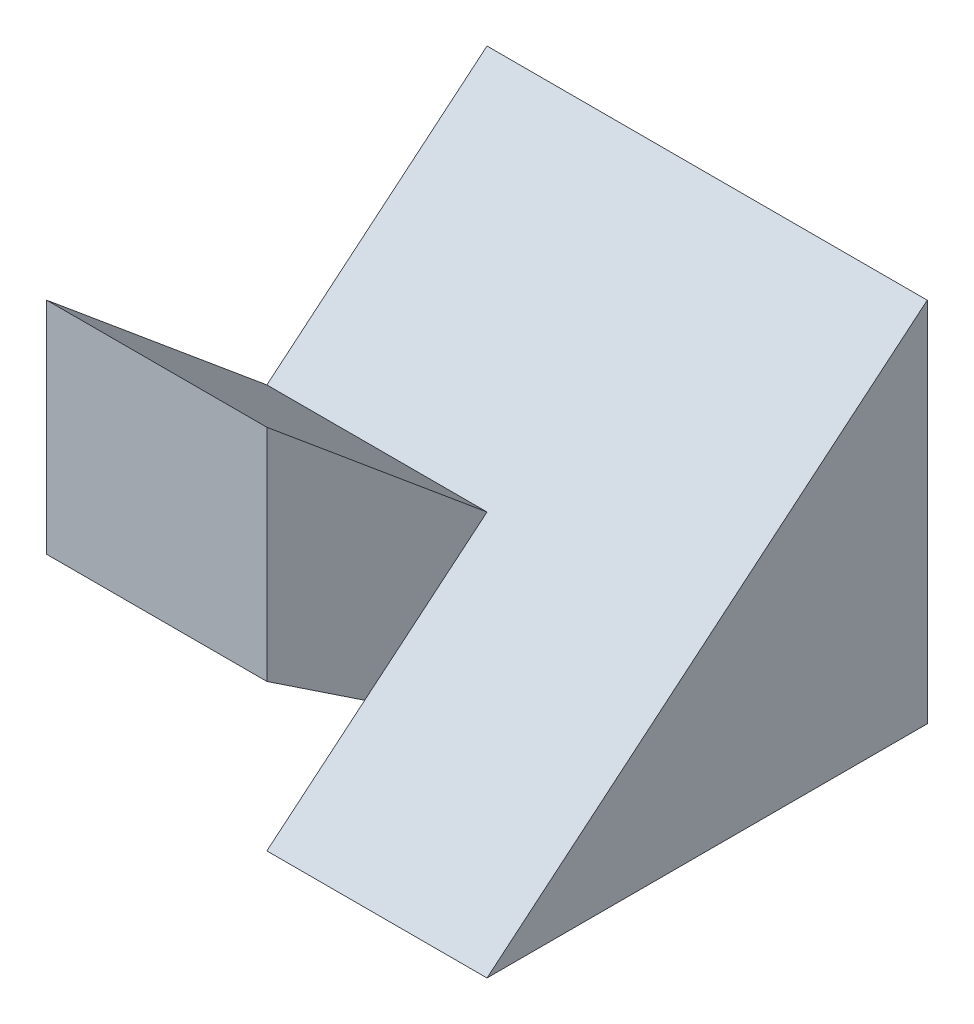
ISO-10303-21;
HEADER;
FILE_DESCRIPTION(('STEP AP214'),'2;1');
FILE_NAME('part.step','',(''),(''),'','','');
FILE_SCHEMA(('AUTOMOTIVE_DESIGN { 1 0 10303 214 1 1 1 1 }'));
ENDSEC;
DATA;
#1=APPLICATION_CONTEXT('core data for automotive mechanical design processes');
#2=APPLICATION_PROTOCOL_DEFINITION('international standard','automotive_design',2000,#1);
#3=PRODUCT_CONTEXT('',#1,'mechanical');
#4=PRODUCT('Part','Part','',(#3));
#5=PRODUCT_RELATED_PRODUCT_CATEGORY('part','',(#4));
#6=PRODUCT_DEFINITION_FORMATION('','',#4);
#7=PRODUCT_DEFINITION_CONTEXT('part definition',#1,'design');
#8=PRODUCT_DEFINITION('design','',#6,#7);
#9=PRODUCT_DEFINITION_SHAPE('','',#8);
#10=(LENGTH_UNIT() NAMED_UNIT(*) SI_UNIT(.MILLI.,.METRE.));
#11=(NAMED_UNIT(*) PLANE_ANGLE_UNIT() SI_UNIT($,.RADIAN.));
#12=(NAMED_UNIT(*) SI_UNIT($,.STERADIAN.) SOLID_ANGLE_UNIT());
#13=UNCERTAINTY_MEASURE_WITH_UNIT(LENGTH_MEASURE(1.E-05),#10,'distance_accuracy_value','');
#14=(GEOMETRIC_REPRESENTATION_CONTEXT(3) GLOBAL_UNCERTAINTY_ASSIGNED_CONTEXT((#13)) GLOBAL_UNIT_ASSIGNED_CONTEXT((#10,
#11,#12)) REPRESENTATION_CONTEXT('',''));
#15=CARTESIAN_POINT('',(0.,0.,0.));
#16=DIRECTION('',(0.,0.,1.));
#17=DIRECTION('',(1.,0.,0.));
#18=AXIS2_PLACEMENT_3D('',#15,#16,#17);
#19=CARTESIAN_POINT('',(3.,5.,3.));
#20=DIRECTION('',(-1.,0.,0.));
#21=DIRECTION('',(0.,0.,1.));
#22=AXIS2_PLACEMENT_3D('',#19,#20,#21);
#23=PLANE('',#22);
#24=DIRECTION('',(0.,-0.64018439966448,0.768221279597376));
#25=VECTOR('',#24,1.);
#26=CARTESIAN_POINT('',(3.,2.04918032786885,0.540983606557377));
#27=LINE('',#26,#25);
#28=CARTESIAN_POINT('',(3.,5.,-3.));
#29=VERTEX_POINT('',#28);
#30=CARTESIAN_POINT('',(3.,0.,3.));
#31=VERTEX_POINT('',#30);
#32=EDGE_CURVE('E133',#29,#31,#27,.T.);
#33=ORIENTED_EDGE('',*,*,#32,.T.);
#34=DIRECTION('',(0.,0.,-1.));
#35=VECTOR('',#34,1.);
#36=CARTESIAN_POINT('',(3.,0.,3.));
#37=LINE('',#36,#35);
#38=CARTESIAN_POINT('',(3.,0.,-3.));
#39=VERTEX_POINT('',#38);
#40=EDGE_CURVE('E135',#31,#39,#37,.T.);
#41=ORIENTED_EDGE('',*,*,#40,.T.);
#42=DIRECTION('',(0.,-1.,0.));
#43=VECTOR('',#42,1.);
#44=CARTESIAN_POINT('',(3.,5.,-3.));
#45=LINE('',#44,#43);
#46=EDGE_CURVE('E11',#29,#39,#45,.T.);
#47=ORIENTED_EDGE('',*,*,#46,.F.);
#48=EDGE_LOOP('',(#33,#41,#47));
#49=FACE_BOUND('',#48,.T.);
#50=ADVANCED_FACE('F33',(#49),#23,.F.);
#51=CARTESIAN_POINT('',(-3.,5.,3.));
#52=DIRECTION('',(0.,0.,-1.));
#53=DIRECTION('',(-1.,0.,0.));
#54=AXIS2_PLACEMENT_3D('',#51,#52,#53);
#55=PLANE('',#54);
#56=DIRECTION('',(0.,-1.,0.));
#57=VECTOR('',#56,1.);
#58=CARTESIAN_POINT('',(-3.,5.,3.));
#59=LINE('',#58,#57);
#60=CARTESIAN_POINT('',(-3.,5.,3.));
#61=VERTEX_POINT('',#60);
#62=CARTESIAN_POINT('',(-3.,2.,3.));
#63=VERTEX_POINT('',#62);
#64=EDGE_CURVE('E142',#61,#63,#59,.T.);
#65=ORIENTED_EDGE('',*,*,#64,.T.);
#66=DIRECTION('',(-1.,0.,0.));
#67=VECTOR('',#66,1.);
#68=CARTESIAN_POINT('',(0.,2.,3.));
#69=LINE('',#68,#67);
#70=CARTESIAN_POINT('',(0.,2.,3.));
#71=VERTEX_POINT('',#70);
#72=EDGE_CURVE('E108',#71,#63,#69,.T.);
#73=ORIENTED_EDGE('',*,*,#72,.F.);
#74=DIRECTION('',(0.,-1.,0.));
#75=VECTOR('',#74,1.);
#76=CARTESIAN_POINT('',(0.,0.,3.));
#77=LINE('',#76,#75);
#78=CARTESIAN_POINT('',(0.,5.,3.));
#79=VERTEX_POINT('',#78);
#80=EDGE_CURVE('E122',#79,#71,#77,.T.);
#81=ORIENTED_EDGE('',*,*,#80,.F.);
#82=DIRECTION('',(1.,0.,0.));
#83=VECTOR('',#82,1.);
#84=CARTESIAN_POINT('',(-3.,5.,3.));
#85=LINE('',#84,#83);
#86=EDGE_CURVE('E138',#61,#79,#85,.T.);
#87=ORIENTED_EDGE('',*,*,#86,.F.);
#88=EDGE_LOOP('',(#65,#73,#81,#87));
#89=FACE_BOUND('',#88,.T.);
#90=ADVANCED_FACE('F171',(#89),#55,.F.);
#91=CARTESIAN_POINT('',(7.,1.47540983606557,-1.22950819672131));
#92=DIRECTION('',(0.,-0.768221279597376,0.64018439966448));
#93=DIRECTION('',(0.,-0.64018439966448,-0.768221279597376));
#94=AXIS2_PLACEMENT_3D('',#91,#92,#93);
#95=PLANE('',#94);
#96=DIRECTION('',(0.,0.64018439966448,0.768221279597376));
#97=VECTOR('',#96,1.);
#98=CARTESIAN_POINT('',(0.,1.47540983606557,-1.22950819672131));
#99=LINE('',#98,#97);
#100=CARTESIAN_POINT('',(0.,2.5,0.));
#101=VERTEX_POINT('',#100);
#102=EDGE_CURVE('E120',#101,#79,#99,.T.);
#103=ORIENTED_EDGE('',*,*,#102,.F.);
#104=DIRECTION('',(-1.,0.,0.));
#105=VECTOR('',#104,1.);
#106=CARTESIAN_POINT('',(7.,2.5,0.));
#107=LINE('',#106,#105);
#108=CARTESIAN_POINT('',(-3.,2.5,0.));
#109=VERTEX_POINT('',#108);
#110=EDGE_CURVE('E131',#101,#109,#107,.T.);
#111=ORIENTED_EDGE('',*,*,#110,.T.);
#112=DIRECTION('',(0.,0.64018439966448,0.768221279597376));
#113=VECTOR('',#112,1.);
#114=CARTESIAN_POINT('',(-3.,1.47540983606557,-1.22950819672131));
#115=LINE('',#114,#113);
#116=EDGE_CURVE('E129',#109,#61,#115,.T.);
#117=ORIENTED_EDGE('',*,*,#116,.T.);
#118=ORIENTED_EDGE('',*,*,#86,.T.);
#119=EDGE_LOOP('',(#103,#111,#117,#118));
#120=FACE_BOUND('',#119,.T.);
#121=ADVANCED_FACE('F164',(#120),#95,.F.);
#122=CARTESIAN_POINT('',(-3.,5.,-3.));
#123=DIRECTION('',(0.,0.,1.));
#124=DIRECTION('',(1.,0.,0.));
#125=AXIS2_PLACEMENT_3D('',#122,#123,#124);
#126=PLANE('',#125);
#127=DIRECTION('',(-1.,0.,0.));
#128=VECTOR('',#127,1.);
#129=CARTESIAN_POINT('',(-3.,0.,-3.));
#130=LINE('',#129,#128);
#131=CARTESIAN_POINT('',(-3.,0.,-3.));
#132=VERTEX_POINT('',#131);
#133=EDGE_CURVE('E145',#39,#132,#130,.T.);
#134=ORIENTED_EDGE('',*,*,#133,.T.);
#135=DIRECTION('',(0.,-1.,0.));
#136=VECTOR('',#135,1.);
#137=CARTESIAN_POINT('',(-3.,5.,-3.));
#138=LINE('',#137,#136);
#139=CARTESIAN_POINT('',(-3.,5.,-3.));
#140=VERTEX_POINT('',#139);
#141=EDGE_CURVE('E40',#140,#132,#138,.T.);
#142=ORIENTED_EDGE('',*,*,#141,.F.);
#143=DIRECTION('',(-1.,0.,0.));
#144=VECTOR('',#143,1.);
#145=CARTESIAN_POINT('',(-3.,5.,-3.));
#146=LINE('',#145,#144);
#147=EDGE_CURVE('E136',#29,#140,#146,.T.);
#148=ORIENTED_EDGE('',*,*,#147,.F.);
#149=ORIENTED_EDGE('',*,*,#46,.T.);
#150=EDGE_LOOP('',(#134,#142,#148,#149));
#151=FACE_BOUND('',#150,.T.);
#152=ADVANCED_FACE('F158',(#151),#126,.F.);
#153=CARTESIAN_POINT('',(-3.,5.,3.));
#154=DIRECTION('',(1.,0.,0.));
#155=DIRECTION('',(0.,0.,-1.));
#156=AXIS2_PLACEMENT_3D('',#153,#154,#155);
#157=PLANE('',#156);
#158=DIRECTION('',(0.,0.,1.));
#159=VECTOR('',#158,1.);
#160=CARTESIAN_POINT('',(-3.,0.,3.));
#161=LINE('',#160,#159);
#162=CARTESIAN_POINT('',(-3.,0.,0.));
#163=VERTEX_POINT('',#162);
#164=EDGE_CURVE('E139',#132,#163,#161,.T.);
#165=ORIENTED_EDGE('',*,*,#164,.T.);
#166=DIRECTION('',(0.,-0.554700196225229,-0.832050294337844));
#167=VECTOR('',#166,1.);
#168=CARTESIAN_POINT('',(-3.,0.,0.));
#169=LINE('',#168,#167);
#170=EDGE_CURVE('E99',#63,#163,#169,.T.);
#171=ORIENTED_EDGE('',*,*,#170,.F.);
#172=ORIENTED_EDGE('',*,*,#64,.F.);
#173=ORIENTED_EDGE('',*,*,#116,.F.);
#174=DIRECTION('',(0.,-0.64018439966448,0.768221279597376));
#175=VECTOR('',#174,1.);
#176=CARTESIAN_POINT('',(-3.,1.47540983606557,1.22950819672131));
#177=LINE('',#176,#175);
#178=EDGE_CURVE('E126',#140,#109,#177,.T.);
#179=ORIENTED_EDGE('',*,*,#178,.F.);
#180=ORIENTED_EDGE('',*,*,#141,.T.);
#181=EDGE_LOOP('',(#165,#171,#172,#173,#179,#180));
#182=FACE_BOUND('',#181,.T.);
#183=ADVANCED_FACE('F153',(#182),#157,.F.);
#184=CARTESIAN_POINT('',(0.,0.,0.));
#185=DIRECTION('',(0.,-1.,0.));
#186=DIRECTION('',(0.,0.,-1.));
#187=AXIS2_PLACEMENT_3D('',#184,#185,#186);
#188=PLANE('',#187);
#189=DIRECTION('',(-1.,0.,0.));
#190=VECTOR('',#189,1.);
#191=CARTESIAN_POINT('',(0.,0.,0.));
#192=LINE('',#191,#190);
#193=CARTESIAN_POINT('',(0.,0.,0.));
#194=VERTEX_POINT('',#193);
#195=EDGE_CURVE('E102',#194,#163,#192,.T.);
#196=ORIENTED_EDGE('',*,*,#195,.T.);
#197=ORIENTED_EDGE('',*,*,#164,.F.);
#198=ORIENTED_EDGE('',*,*,#133,.F.);
#199=ORIENTED_EDGE('',*,*,#40,.F.);
#200=DIRECTION('',(1.,0.,0.));
#201=VECTOR('',#200,1.);
#202=CARTESIAN_POINT('',(0.,0.,3.));
#203=LINE('',#202,#201);
#204=CARTESIAN_POINT('',(0.,0.,3.));
#205=VERTEX_POINT('',#204);
#206=EDGE_CURVE('E114',#205,#31,#203,.T.);
#207=ORIENTED_EDGE('',*,*,#206,.F.);
#208=DIRECTION('',(0.,0.,1.));
#209=VECTOR('',#208,1.);
#210=CARTESIAN_POINT('',(0.,0.,0.));
#211=LINE('',#210,#209);
#212=EDGE_CURVE('E95',#194,#205,#211,.T.);
#213=ORIENTED_EDGE('',*,*,#212,.F.);
#214=EDGE_LOOP('',(#196,#197,#198,#199,#207,#213));
#215=FACE_BOUND('',#214,.T.);
#216=ADVANCED_FACE('F111',(#215),#188,.T.);
#217=CARTESIAN_POINT('',(7.,1.47540983606557,1.22950819672131));
#218=DIRECTION('',(0.,-0.768221279597376,-0.64018439966448));
#219=DIRECTION('',(0.,0.64018439966448,-0.768221279597376));
#220=AXIS2_PLACEMENT_3D('',#217,#218,#219);
#221=PLANE('',#220);
#222=ORIENTED_EDGE('',*,*,#147,.T.);
#223=ORIENTED_EDGE('',*,*,#178,.T.);
#224=ORIENTED_EDGE('',*,*,#110,.F.);
#225=DIRECTION('',(0.,-0.64018439966448,0.768221279597376));
#226=VECTOR('',#225,1.);
#227=CARTESIAN_POINT('',(0.,1.47540983606557,1.22950819672131));
#228=LINE('',#227,#226);
#229=CARTESIAN_POINT('',(0.,1.11111111111111,1.66666666666667));
#230=VERTEX_POINT('',#229);
#231=EDGE_CURVE('E55',#101,#230,#228,.T.);
#232=ORIENTED_EDGE('',*,*,#231,.T.);
#233=EDGE_CURVE('E97',#230,#205,#228,.T.);
#234=ORIENTED_EDGE('',*,*,#233,.T.);
#235=ORIENTED_EDGE('',*,*,#206,.T.);
#236=ORIENTED_EDGE('',*,*,#32,.F.);
#237=EDGE_LOOP('',(#222,#223,#224,#232,#234,#235,#236));
#238=FACE_BOUND('',#237,.T.);
#239=ADVANCED_FACE('F161',(#238),#221,.F.);
#240=CARTESIAN_POINT('',(0.,0.,0.));
#241=DIRECTION('',(1.,0.,0.));
#242=DIRECTION('',(0.,0.,-1.));
#243=AXIS2_PLACEMENT_3D('',#240,#241,#242);
#244=PLANE('',#243);
#245=DIRECTION('',(0.,-0.554700196225229,-0.832050294337844));
#246=VECTOR('',#245,1.);
#247=CARTESIAN_POINT('',(0.,0.,0.));
#248=LINE('',#247,#246);
#249=EDGE_CURVE('E98',#71,#230,#248,.T.);
#250=ORIENTED_EDGE('',*,*,#249,.T.);
#251=ORIENTED_EDGE('',*,*,#231,.F.);
#252=ORIENTED_EDGE('',*,*,#102,.T.);
#253=ORIENTED_EDGE('',*,*,#80,.T.);
#254=EDGE_LOOP('',(#250,#251,#252,#253));
#255=FACE_BOUND('',#254,.T.);
#256=ADVANCED_FACE('F168',(#255),#244,.T.);
#257=CARTESIAN_POINT('',(0.,0.,0.));
#258=DIRECTION('',(-1.,0.,0.));
#259=DIRECTION('',(0.,0.,1.));
#260=AXIS2_PLACEMENT_3D('',#257,#258,#259);
#261=PLANE('',#260);
#262=ORIENTED_EDGE('',*,*,#233,.F.);
#263=EDGE_CURVE('E47',#230,#194,#248,.T.);
#264=ORIENTED_EDGE('',*,*,#263,.T.);
#265=ORIENTED_EDGE('',*,*,#212,.T.);
#266=EDGE_LOOP('',(#262,#264,#265));
#267=FACE_BOUND('',#266,.T.);
#268=ADVANCED_FACE('F93',(#267),#261,.T.);
#269=CARTESIAN_POINT('',(0.,0.,0.));
#270=DIRECTION('',(0.,0.832050294337844,-0.554700196225229));
#271=DIRECTION('',(0.,0.554700196225229,0.832050294337844));
#272=AXIS2_PLACEMENT_3D('',#269,#270,#271);
#273=PLANE('',#272);
#274=ORIENTED_EDGE('',*,*,#170,.T.);
#275=ORIENTED_EDGE('',*,*,#195,.F.);
#276=ORIENTED_EDGE('',*,*,#263,.F.);
#277=ORIENTED_EDGE('',*,*,#249,.F.);
#278=ORIENTED_EDGE('',*,*,#72,.T.);
#279=EDGE_LOOP('',(#274,#275,#276,#277,#278));
#280=FACE_BOUND('',#279,.T.);
#281=ADVANCED_FACE('F103',(#280),#273,.F.);
#282=CLOSED_SHELL('',(#50,#90,#121,#152,#183,#216,#239,#256,#268,#281));
#283=MANIFOLD_SOLID_BREP('B2',#282);
#284=ADVANCED_BREP_SHAPE_REPRESENTATION('',(#18,#283),#14);
#285=SHAPE_DEFINITION_REPRESENTATION(#9,#284);
ENDSEC;
END-ISO-10303-21;
